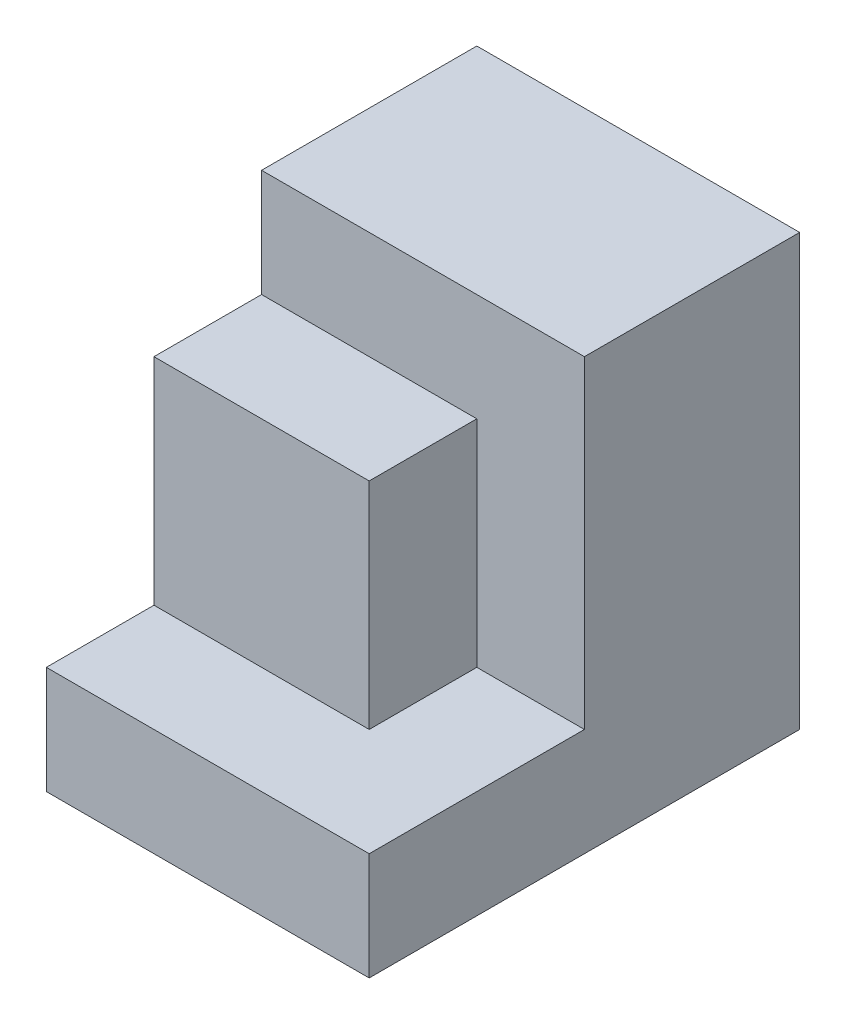
ISO-10303-21;
HEADER;
FILE_DESCRIPTION(('STEP AP214'),'2;1');
FILE_NAME('part.step','',(''),(''),'','','');
FILE_SCHEMA(('AUTOMOTIVE_DESIGN { 1 0 10303 214 1 1 1 1 }'));
ENDSEC;
DATA;
#1=APPLICATION_CONTEXT('core data for automotive mechanical design processes');
#2=APPLICATION_PROTOCOL_DEFINITION('international standard','automotive_design',2000,#1);
#3=PRODUCT_CONTEXT('',#1,'mechanical');
#4=PRODUCT('Part','Part','',(#3));
#5=PRODUCT_RELATED_PRODUCT_CATEGORY('part','',(#4));
#6=PRODUCT_DEFINITION_FORMATION('','',#4);
#7=PRODUCT_DEFINITION_CONTEXT('part definition',#1,'design');
#8=PRODUCT_DEFINITION('design','',#6,#7);
#9=PRODUCT_DEFINITION_SHAPE('','',#8);
#10=(LENGTH_UNIT() NAMED_UNIT(*) SI_UNIT(.MILLI.,.METRE.));
#11=(NAMED_UNIT(*) PLANE_ANGLE_UNIT() SI_UNIT($,.RADIAN.));
#12=(NAMED_UNIT(*) SI_UNIT($,.STERADIAN.) SOLID_ANGLE_UNIT());
#13=UNCERTAINTY_MEASURE_WITH_UNIT(LENGTH_MEASURE(1.E-05),#10,'distance_accuracy_value','');
#14=(GEOMETRIC_REPRESENTATION_CONTEXT(3) GLOBAL_UNCERTAINTY_ASSIGNED_CONTEXT((#13)) GLOBAL_UNIT_ASSIGNED_CONTEXT((#10,
#11,#12)) REPRESENTATION_CONTEXT('',''));
#15=CARTESIAN_POINT('',(0.,0.,0.));
#16=DIRECTION('',(0.,0.,1.));
#17=DIRECTION('',(1.,0.,0.));
#18=AXIS2_PLACEMENT_3D('',#15,#16,#17);
#19=CARTESIAN_POINT('',(0.,40.,40.));
#20=DIRECTION('',(0.,-1.,0.));
#21=DIRECTION('',(0.,0.,-1.));
#22=AXIS2_PLACEMENT_3D('',#19,#20,#21);
#23=PLANE('',#22);
#24=DIRECTION('',(0.,0.,1.));
#25=VECTOR('',#24,1.);
#26=CARTESIAN_POINT('',(10.,40.,0.));
#27=LINE('',#26,#25);
#28=CARTESIAN_POINT('',(10.,40.,0.));
#29=VERTEX_POINT('',#28);
#30=CARTESIAN_POINT('',(10.,40.,20.));
#31=VERTEX_POINT('',#30);
#32=EDGE_CURVE('E182',#29,#31,#27,.T.);
#33=ORIENTED_EDGE('',*,*,#32,.T.);
#34=DIRECTION('',(-1.,0.,0.));
#35=VECTOR('',#34,1.);
#36=CARTESIAN_POINT('',(40.,40.,20.));
#37=LINE('',#36,#35);
#38=CARTESIAN_POINT('',(40.,40.,20.));
#39=VERTEX_POINT('',#38);
#40=EDGE_CURVE('E129',#39,#31,#37,.T.);
#41=ORIENTED_EDGE('',*,*,#40,.F.);
#42=DIRECTION('',(0.,0.,-1.));
#43=VECTOR('',#42,1.);
#44=CARTESIAN_POINT('',(40.,40.,40.));
#45=LINE('',#44,#43);
#46=CARTESIAN_POINT('',(40.,40.,0.));
#47=VERTEX_POINT('',#46);
#48=EDGE_CURVE('E194',#39,#47,#45,.T.);
#49=ORIENTED_EDGE('',*,*,#48,.T.);
#50=DIRECTION('',(-1.,0.,0.));
#51=VECTOR('',#50,1.);
#52=CARTESIAN_POINT('',(0.,40.,0.));
#53=LINE('',#52,#51);
#54=EDGE_CURVE('E191',#47,#29,#53,.T.);
#55=ORIENTED_EDGE('',*,*,#54,.T.);
#56=EDGE_LOOP('',(#33,#41,#49,#55));
#57=FACE_BOUND('',#56,.T.);
#58=ADVANCED_FACE('F33',(#57),#23,.F.);
#59=CARTESIAN_POINT('',(10.,0.,0.));
#60=DIRECTION('',(-1.,0.,0.));
#61=DIRECTION('',(0.,-1.,0.));
#62=AXIS2_PLACEMENT_3D('',#59,#60,#61);
#63=PLANE('',#62);
#64=DIRECTION('',(0.,0.,1.));
#65=VECTOR('',#64,1.);
#66=CARTESIAN_POINT('',(10.,30.,20.));
#67=LINE('',#66,#65);
#68=CARTESIAN_POINT('',(10.,30.,20.));
#69=VERTEX_POINT('',#68);
#70=CARTESIAN_POINT('',(10.,30.,30.));
#71=VERTEX_POINT('',#70);
#72=EDGE_CURVE('E119',#69,#71,#67,.T.);
#73=ORIENTED_EDGE('',*,*,#72,.F.);
#74=DIRECTION('',(0.,-1.,0.));
#75=VECTOR('',#74,1.);
#76=CARTESIAN_POINT('',(10.,40.,20.));
#77=LINE('',#76,#75);
#78=EDGE_CURVE('E124',#31,#69,#77,.T.);
#79=ORIENTED_EDGE('',*,*,#78,.F.);
#80=ORIENTED_EDGE('',*,*,#32,.F.);
#81=DIRECTION('',(0.,-1.,0.));
#82=VECTOR('',#81,1.);
#83=CARTESIAN_POINT('',(10.,0.,0.));
#84=LINE('',#83,#82);
#85=CARTESIAN_POINT('',(10.,0.,0.));
#86=VERTEX_POINT('',#85);
#87=EDGE_CURVE('E180',#29,#86,#84,.T.);
#88=ORIENTED_EDGE('',*,*,#87,.T.);
#89=DIRECTION('',(0.,0.,1.));
#90=VECTOR('',#89,1.);
#91=CARTESIAN_POINT('',(10.,0.,0.));
#92=LINE('',#91,#90);
#93=CARTESIAN_POINT('',(10.,0.,10.));
#94=VERTEX_POINT('',#93);
#95=EDGE_CURVE('E171',#86,#94,#92,.T.);
#96=ORIENTED_EDGE('',*,*,#95,.T.);
#97=DIRECTION('',(0.,-1.,0.));
#98=VECTOR('',#97,1.);
#99=CARTESIAN_POINT('',(10.,40.,10.));
#100=LINE('',#99,#98);
#101=CARTESIAN_POINT('',(10.,10.,10.));
#102=VERTEX_POINT('',#101);
#103=EDGE_CURVE('E177',#102,#94,#100,.T.);
#104=ORIENTED_EDGE('',*,*,#103,.F.);
#105=DIRECTION('',(0.,0.,1.));
#106=VECTOR('',#105,1.);
#107=CARTESIAN_POINT('',(10.,10.,0.));
#108=LINE('',#107,#106);
#109=CARTESIAN_POINT('',(10.,10.,30.));
#110=VERTEX_POINT('',#109);
#111=EDGE_CURVE('E184',#102,#110,#108,.T.);
#112=ORIENTED_EDGE('',*,*,#111,.T.);
#113=DIRECTION('',(0.,1.,0.));
#114=VECTOR('',#113,1.);
#115=CARTESIAN_POINT('',(10.,10.,30.));
#116=LINE('',#115,#114);
#117=EDGE_CURVE('E138',#110,#71,#116,.T.);
#118=ORIENTED_EDGE('',*,*,#117,.T.);
#119=EDGE_LOOP('',(#73,#79,#80,#88,#96,#104,#112,#118));
#120=FACE_BOUND('',#119,.T.);
#121=ADVANCED_FACE('F135',(#120),#63,.T.);
#122=CARTESIAN_POINT('',(0.,0.,40.));
#123=DIRECTION('',(0.,0.,-1.));
#124=DIRECTION('',(-1.,0.,0.));
#125=AXIS2_PLACEMENT_3D('',#122,#123,#124);
#126=PLANE('',#125);
#127=DIRECTION('',(0.,1.,0.));
#128=VECTOR('',#127,1.);
#129=CARTESIAN_POINT('',(40.,0.,40.));
#130=LINE('',#129,#128);
#131=CARTESIAN_POINT('',(40.,0.,40.));
#132=VERTEX_POINT('',#131);
#133=CARTESIAN_POINT('',(40.,10.,40.));
#134=VERTEX_POINT('',#133);
#135=EDGE_CURVE('E190',#132,#134,#130,.T.);
#136=ORIENTED_EDGE('',*,*,#135,.T.);
#137=DIRECTION('',(1.,0.,0.));
#138=VECTOR('',#137,1.);
#139=CARTESIAN_POINT('',(10.,10.,40.));
#140=LINE('',#139,#138);
#141=CARTESIAN_POINT('',(10.,10.,40.));
#142=VERTEX_POINT('',#141);
#143=EDGE_CURVE('E156',#142,#134,#140,.T.);
#144=ORIENTED_EDGE('',*,*,#143,.F.);
#145=DIRECTION('',(0.,-1.,0.));
#146=VECTOR('',#145,1.);
#147=CARTESIAN_POINT('',(10.,0.,40.));
#148=LINE('',#147,#146);
#149=CARTESIAN_POINT('',(10.,0.,40.));
#150=VERTEX_POINT('',#149);
#151=EDGE_CURVE('E179',#142,#150,#148,.T.);
#152=ORIENTED_EDGE('',*,*,#151,.T.);
#153=DIRECTION('',(1.,0.,0.));
#154=VECTOR('',#153,1.);
#155=CARTESIAN_POINT('',(0.,0.,40.));
#156=LINE('',#155,#154);
#157=EDGE_CURVE('E188',#150,#132,#156,.T.);
#158=ORIENTED_EDGE('',*,*,#157,.T.);
#159=EDGE_LOOP('',(#136,#144,#152,#158));
#160=FACE_BOUND('',#159,.T.);
#161=ADVANCED_FACE('F235',(#160),#126,.F.);
#162=CARTESIAN_POINT('',(0.,0.,0.));
#163=DIRECTION('',(0.,0.,-1.));
#164=DIRECTION('',(-1.,0.,0.));
#165=AXIS2_PLACEMENT_3D('',#162,#163,#164);
#166=PLANE('',#165);
#167=DIRECTION('',(1.,0.,0.));
#168=VECTOR('',#167,1.);
#169=CARTESIAN_POINT('',(0.,0.,0.));
#170=LINE('',#169,#168);
#171=CARTESIAN_POINT('',(40.,0.,0.));
#172=VERTEX_POINT('',#171);
#173=EDGE_CURVE('E186',#86,#172,#170,.T.);
#174=ORIENTED_EDGE('',*,*,#173,.F.);
#175=ORIENTED_EDGE('',*,*,#87,.F.);
#176=ORIENTED_EDGE('',*,*,#54,.F.);
#177=DIRECTION('',(0.,1.,0.));
#178=VECTOR('',#177,1.);
#179=CARTESIAN_POINT('',(40.,0.,0.));
#180=LINE('',#179,#178);
#181=EDGE_CURVE('E196',#172,#47,#180,.T.);
#182=ORIENTED_EDGE('',*,*,#181,.F.);
#183=EDGE_LOOP('',(#174,#175,#176,#182));
#184=FACE_BOUND('',#183,.T.);
#185=ADVANCED_FACE('F264',(#184),#166,.T.);
#186=CARTESIAN_POINT('',(0.,0.,40.));
#187=DIRECTION('',(0.,1.,0.));
#188=DIRECTION('',(0.,0.,1.));
#189=AXIS2_PLACEMENT_3D('',#186,#187,#188);
#190=PLANE('',#189);
#191=ORIENTED_EDGE('',*,*,#157,.F.);
#192=DIRECTION('',(0.,0.,1.));
#193=VECTOR('',#192,1.);
#194=CARTESIAN_POINT('',(10.,0.,40.));
#195=LINE('',#194,#193);
#196=CARTESIAN_POINT('',(10.,0.,30.));
#197=VERTEX_POINT('',#196);
#198=EDGE_CURVE('E166',#197,#150,#195,.T.);
#199=ORIENTED_EDGE('',*,*,#198,.F.);
#200=DIRECTION('',(1.,0.,0.));
#201=VECTOR('',#200,1.);
#202=CARTESIAN_POINT('',(0.,0.,30.));
#203=LINE('',#202,#201);
#204=CARTESIAN_POINT('',(0.,0.,30.));
#205=VERTEX_POINT('',#204);
#206=EDGE_CURVE('E163',#205,#197,#203,.T.);
#207=ORIENTED_EDGE('',*,*,#206,.F.);
#208=DIRECTION('',(0.,0.,-1.));
#209=VECTOR('',#208,1.);
#210=CARTESIAN_POINT('',(0.,0.,40.));
#211=LINE('',#210,#209);
#212=CARTESIAN_POINT('',(0.,0.,10.));
#213=VERTEX_POINT('',#212);
#214=EDGE_CURVE('E205',#205,#213,#211,.T.);
#215=ORIENTED_EDGE('',*,*,#214,.T.);
#216=DIRECTION('',(-1.,0.,0.));
#217=VECTOR('',#216,1.);
#218=CARTESIAN_POINT('',(0.,0.,10.));
#219=LINE('',#218,#217);
#220=EDGE_CURVE('E174',#94,#213,#219,.T.);
#221=ORIENTED_EDGE('',*,*,#220,.F.);
#222=ORIENTED_EDGE('',*,*,#95,.F.);
#223=ORIENTED_EDGE('',*,*,#173,.T.);
#224=DIRECTION('',(0.,0.,-1.));
#225=VECTOR('',#224,1.);
#226=CARTESIAN_POINT('',(40.,0.,40.));
#227=LINE('',#226,#225);
#228=EDGE_CURVE('E202',#132,#172,#227,.T.);
#229=ORIENTED_EDGE('',*,*,#228,.F.);
#230=EDGE_LOOP('',(#191,#199,#207,#215,#221,#222,#223,#229));
#231=FACE_BOUND('',#230,.T.);
#232=ADVANCED_FACE('F35',(#231),#190,.F.);
#233=CARTESIAN_POINT('',(40.,0.,40.));
#234=DIRECTION('',(-1.,0.,0.));
#235=DIRECTION('',(0.,0.,1.));
#236=AXIS2_PLACEMENT_3D('',#233,#234,#235);
#237=PLANE('',#236);
#238=ORIENTED_EDGE('',*,*,#48,.F.);
#239=DIRECTION('',(0.,1.,0.));
#240=VECTOR('',#239,1.);
#241=CARTESIAN_POINT('',(40.,10.,20.));
#242=LINE('',#241,#240);
#243=CARTESIAN_POINT('',(40.,10.,20.));
#244=VERTEX_POINT('',#243);
#245=EDGE_CURVE('E146',#244,#39,#242,.T.);
#246=ORIENTED_EDGE('',*,*,#245,.F.);
#247=DIRECTION('',(0.,0.,-1.));
#248=VECTOR('',#247,1.);
#249=CARTESIAN_POINT('',(40.,10.,40.));
#250=LINE('',#249,#248);
#251=EDGE_CURVE('E158',#134,#244,#250,.T.);
#252=ORIENTED_EDGE('',*,*,#251,.F.);
#253=ORIENTED_EDGE('',*,*,#135,.F.);
#254=ORIENTED_EDGE('',*,*,#228,.T.);
#255=ORIENTED_EDGE('',*,*,#181,.T.);
#256=EDGE_LOOP('',(#238,#246,#252,#253,#254,#255));
#257=FACE_BOUND('',#256,.T.);
#258=ADVANCED_FACE('F240',(#257),#237,.F.);
#259=DIRECTION('',(0.,0.,1.));
#260=VECTOR('',#259,1.);
#261=CARTESIAN_POINT('',(10.,10.,40.));
#262=LINE('',#261,#260);
#263=EDGE_CURVE('E151',#110,#142,#262,.T.);
#264=ORIENTED_EDGE('',*,*,#263,.F.);
#265=DIRECTION('',(0.,-1.,0.));
#266=VECTOR('',#265,1.);
#267=CARTESIAN_POINT('',(10.,40.,30.));
#268=LINE('',#267,#266);
#269=EDGE_CURVE('E169',#110,#197,#268,.T.);
#270=ORIENTED_EDGE('',*,*,#269,.T.);
#271=ORIENTED_EDGE('',*,*,#198,.T.);
#272=ORIENTED_EDGE('',*,*,#151,.F.);
#273=EDGE_LOOP('',(#264,#270,#271,#272));
#274=FACE_BOUND('',#273,.T.);
#275=ADVANCED_FACE('F228',(#274),#63,.T.);
#276=CARTESIAN_POINT('',(0.,0.,0.));
#277=DIRECTION('',(-0.707106781186547,0.707106781186548,0.));
#278=DIRECTION('',(-0.707106781186548,-0.707106781186547,0.));
#279=AXIS2_PLACEMENT_3D('',#276,#277,#278);
#280=PLANE('',#279);
#281=DIRECTION('',(-0.707106781186548,-0.707106781186547,0.));
#282=VECTOR('',#281,1.);
#283=CARTESIAN_POINT('',(0.,0.,30.));
#284=LINE('',#283,#282);
#285=EDGE_CURVE('E11',#110,#205,#284,.T.);
#286=ORIENTED_EDGE('',*,*,#285,.F.);
#287=ORIENTED_EDGE('',*,*,#111,.F.);
#288=DIRECTION('',(0.707106781186548,0.707106781186547,0.));
#289=VECTOR('',#288,1.);
#290=CARTESIAN_POINT('',(0.,0.,10.));
#291=LINE('',#290,#289);
#292=EDGE_CURVE('E41',#213,#102,#291,.T.);
#293=ORIENTED_EDGE('',*,*,#292,.F.);
#294=ORIENTED_EDGE('',*,*,#214,.F.);
#295=EDGE_LOOP('',(#286,#287,#293,#294));
#296=FACE_BOUND('',#295,.T.);
#297=ADVANCED_FACE('F215',(#296),#280,.T.);
#298=CARTESIAN_POINT('',(0.,40.,10.));
#299=DIRECTION('',(0.,0.,1.));
#300=DIRECTION('',(1.,0.,0.));
#301=AXIS2_PLACEMENT_3D('',#298,#299,#300);
#302=PLANE('',#301);
#303=ORIENTED_EDGE('',*,*,#292,.T.);
#304=ORIENTED_EDGE('',*,*,#103,.T.);
#305=ORIENTED_EDGE('',*,*,#220,.T.);
#306=EDGE_LOOP('',(#303,#304,#305));
#307=FACE_BOUND('',#306,.T.);
#308=ADVANCED_FACE('F210',(#307),#302,.F.);
#309=CARTESIAN_POINT('',(0.,40.,30.));
#310=DIRECTION('',(0.,0.,-1.));
#311=DIRECTION('',(-1.,0.,0.));
#312=AXIS2_PLACEMENT_3D('',#309,#310,#311);
#313=PLANE('',#312);
#314=ORIENTED_EDGE('',*,*,#285,.T.);
#315=ORIENTED_EDGE('',*,*,#206,.T.);
#316=ORIENTED_EDGE('',*,*,#269,.F.);
#317=EDGE_LOOP('',(#314,#315,#316));
#318=FACE_BOUND('',#317,.T.);
#319=ADVANCED_FACE('F225',(#318),#313,.F.);
#320=CARTESIAN_POINT('',(10.,10.,30.));
#321=DIRECTION('',(0.,0.,-1.));
#322=DIRECTION('',(-1.,0.,0.));
#323=AXIS2_PLACEMENT_3D('',#320,#321,#322);
#324=PLANE('',#323);
#325=DIRECTION('',(0.,1.,0.));
#326=VECTOR('',#325,1.);
#327=CARTESIAN_POINT('',(30.,10.,30.));
#328=LINE('',#327,#326);
#329=CARTESIAN_POINT('',(30.,10.,30.));
#330=VERTEX_POINT('',#329);
#331=CARTESIAN_POINT('',(30.,30.,30.));
#332=VERTEX_POINT('',#331);
#333=EDGE_CURVE('E148',#330,#332,#328,.T.);
#334=ORIENTED_EDGE('',*,*,#333,.T.);
#335=DIRECTION('',(1.,0.,0.));
#336=VECTOR('',#335,1.);
#337=CARTESIAN_POINT('',(10.,30.,30.));
#338=LINE('',#337,#336);
#339=EDGE_CURVE('E132',#71,#332,#338,.T.);
#340=ORIENTED_EDGE('',*,*,#339,.F.);
#341=ORIENTED_EDGE('',*,*,#117,.F.);
#342=DIRECTION('',(-1.,0.,0.));
#343=VECTOR('',#342,1.);
#344=CARTESIAN_POINT('',(10.,10.,30.));
#345=LINE('',#344,#343);
#346=EDGE_CURVE('E160',#330,#110,#345,.T.);
#347=ORIENTED_EDGE('',*,*,#346,.F.);
#348=EDGE_LOOP('',(#334,#340,#341,#347));
#349=FACE_BOUND('',#348,.T.);
#350=ADVANCED_FACE('F247',(#349),#324,.F.);
#351=CARTESIAN_POINT('',(0.,10.,0.));
#352=DIRECTION('',(0.,-1.,0.));
#353=DIRECTION('',(0.,0.,-1.));
#354=AXIS2_PLACEMENT_3D('',#351,#352,#353);
#355=PLANE('',#354);
#356=ORIENTED_EDGE('',*,*,#263,.T.);
#357=ORIENTED_EDGE('',*,*,#143,.T.);
#358=ORIENTED_EDGE('',*,*,#251,.T.);
#359=DIRECTION('',(-1.,0.,0.));
#360=VECTOR('',#359,1.);
#361=CARTESIAN_POINT('',(40.,10.,20.));
#362=LINE('',#361,#360);
#363=CARTESIAN_POINT('',(30.,10.,20.));
#364=VERTEX_POINT('',#363);
#365=EDGE_CURVE('E143',#244,#364,#362,.T.);
#366=ORIENTED_EDGE('',*,*,#365,.T.);
#367=DIRECTION('',(0.,0.,1.));
#368=VECTOR('',#367,1.);
#369=CARTESIAN_POINT('',(30.,10.,30.));
#370=LINE('',#369,#368);
#371=EDGE_CURVE('E56',#364,#330,#370,.T.);
#372=ORIENTED_EDGE('',*,*,#371,.T.);
#373=ORIENTED_EDGE('',*,*,#346,.T.);
#374=EDGE_LOOP('',(#356,#357,#358,#366,#372,#373));
#375=FACE_BOUND('',#374,.T.);
#376=ADVANCED_FACE('F231',(#375),#355,.F.);
#377=CARTESIAN_POINT('',(30.,10.,30.));
#378=DIRECTION('',(-1.,0.,0.));
#379=DIRECTION('',(0.,0.,1.));
#380=AXIS2_PLACEMENT_3D('',#377,#378,#379);
#381=PLANE('',#380);
#382=DIRECTION('',(0.,1.,0.));
#383=VECTOR('',#382,1.);
#384=CARTESIAN_POINT('',(30.,10.,20.));
#385=LINE('',#384,#383);
#386=CARTESIAN_POINT('',(30.,30.,20.));
#387=VERTEX_POINT('',#386);
#388=EDGE_CURVE('E152',#364,#387,#385,.T.);
#389=ORIENTED_EDGE('',*,*,#388,.T.);
#390=DIRECTION('',(0.,0.,1.));
#391=VECTOR('',#390,1.);
#392=CARTESIAN_POINT('',(30.,30.,20.));
#393=LINE('',#392,#391);
#394=EDGE_CURVE('E122',#387,#332,#393,.T.);
#395=ORIENTED_EDGE('',*,*,#394,.T.);
#396=ORIENTED_EDGE('',*,*,#333,.F.);
#397=ORIENTED_EDGE('',*,*,#371,.F.);
#398=EDGE_LOOP('',(#389,#395,#396,#397));
#399=FACE_BOUND('',#398,.T.);
#400=ADVANCED_FACE('F245',(#399),#381,.F.);
#401=CARTESIAN_POINT('',(40.,10.,20.));
#402=DIRECTION('',(0.,0.,-1.));
#403=DIRECTION('',(-1.,0.,0.));
#404=AXIS2_PLACEMENT_3D('',#401,#402,#403);
#405=PLANE('',#404);
#406=ORIENTED_EDGE('',*,*,#40,.T.);
#407=ORIENTED_EDGE('',*,*,#78,.T.);
#408=DIRECTION('',(1.,0.,0.));
#409=VECTOR('',#408,1.);
#410=CARTESIAN_POINT('',(10.,30.,20.));
#411=LINE('',#410,#409);
#412=EDGE_CURVE('E48',#69,#387,#411,.T.);
#413=ORIENTED_EDGE('',*,*,#412,.T.);
#414=ORIENTED_EDGE('',*,*,#388,.F.);
#415=ORIENTED_EDGE('',*,*,#365,.F.);
#416=ORIENTED_EDGE('',*,*,#245,.T.);
#417=EDGE_LOOP('',(#406,#407,#413,#414,#415,#416));
#418=FACE_BOUND('',#417,.T.);
#419=ADVANCED_FACE('F127',(#418),#405,.F.);
#420=CARTESIAN_POINT('',(10.,30.,20.));
#421=DIRECTION('',(0.,-1.,0.));
#422=DIRECTION('',(0.,0.,-1.));
#423=AXIS2_PLACEMENT_3D('',#420,#421,#422);
#424=PLANE('',#423);
#425=ORIENTED_EDGE('',*,*,#339,.T.);
#426=ORIENTED_EDGE('',*,*,#394,.F.);
#427=ORIENTED_EDGE('',*,*,#412,.F.);
#428=ORIENTED_EDGE('',*,*,#72,.T.);
#429=EDGE_LOOP('',(#425,#426,#427,#428));
#430=FACE_BOUND('',#429,.T.);
#431=ADVANCED_FACE('F117',(#430),#424,.F.);
#432=CLOSED_SHELL('',(#58,#121,#161,#185,#232,#258,#275,#297,#308,#319,#350,#376,#400,#419,#431));
#433=MANIFOLD_SOLID_BREP('B2',#432);
#434=ADVANCED_BREP_SHAPE_REPRESENTATION('',(#18,#433),#14);
#435=SHAPE_DEFINITION_REPRESENTATION(#9,#434);
ENDSEC;
END-ISO-10303-21;
